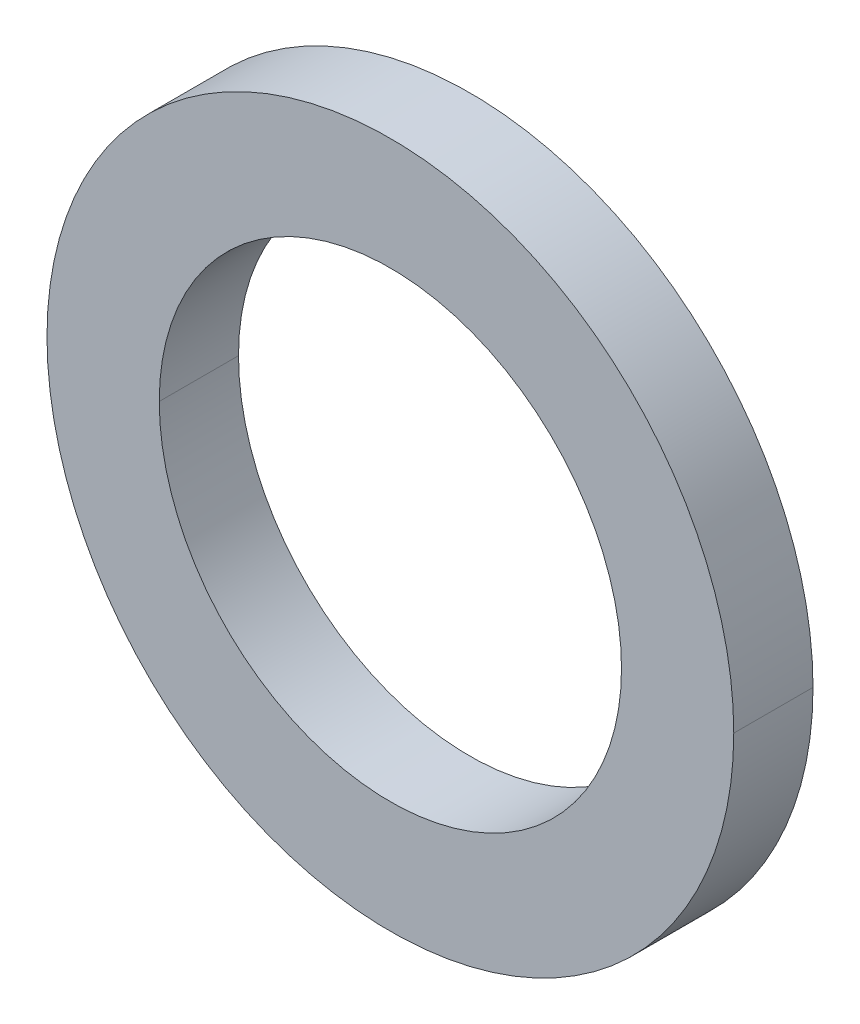
ISO-10303-21;
HEADER;
FILE_DESCRIPTION(('STEP AP214'),'2;1');
FILE_NAME('part.step','',(''),(''),'','','');
FILE_SCHEMA(('AUTOMOTIVE_DESIGN { 1 0 10303 214 1 1 1 1 }'));
ENDSEC;
DATA;
#1=APPLICATION_CONTEXT('core data for automotive mechanical design processes');
#2=APPLICATION_PROTOCOL_DEFINITION('international standard','automotive_design',2000,#1);
#3=PRODUCT_CONTEXT('',#1,'mechanical');
#4=PRODUCT('Part','Part','',(#3));
#5=PRODUCT_RELATED_PRODUCT_CATEGORY('part','',(#4));
#6=PRODUCT_DEFINITION_FORMATION('','',#4);
#7=PRODUCT_DEFINITION_CONTEXT('part definition',#1,'design');
#8=PRODUCT_DEFINITION('design','',#6,#7);
#9=PRODUCT_DEFINITION_SHAPE('','',#8);
#10=(LENGTH_UNIT() NAMED_UNIT(*) SI_UNIT(.MILLI.,.METRE.));
#11=(NAMED_UNIT(*) PLANE_ANGLE_UNIT() SI_UNIT($,.RADIAN.));
#12=(NAMED_UNIT(*) SI_UNIT($,.STERADIAN.) SOLID_ANGLE_UNIT());
#13=UNCERTAINTY_MEASURE_WITH_UNIT(LENGTH_MEASURE(1.E-05),#10,'distance_accuracy_value','');
#14=(GEOMETRIC_REPRESENTATION_CONTEXT(3) GLOBAL_UNCERTAINTY_ASSIGNED_CONTEXT((#13)) GLOBAL_UNIT_ASSIGNED_CONTEXT((#10,
#11,#12)) REPRESENTATION_CONTEXT('',''));
#15=CARTESIAN_POINT('',(0.,0.,0.));
#16=DIRECTION('',(0.,0.,1.));
#17=DIRECTION('',(1.,0.,0.));
#18=AXIS2_PLACEMENT_3D('',#15,#16,#17);
#19=CARTESIAN_POINT('',(0.,0.,35.3));
#20=DIRECTION('',(0.,0.,1.));
#21=DIRECTION('',(1.,0.,0.));
#22=AXIS2_PLACEMENT_3D('',#19,#20,#21);
#23=CYLINDRICAL_SURFACE('',#22,26.);
#24=DIRECTION('',(0.,0.,1.));
#25=VECTOR('',#24,1.);
#26=CARTESIAN_POINT('',(26.,0.,35.3));
#27=LINE('',#26,#25);
#28=CARTESIAN_POINT('',(26.,0.,32.3));
#29=VERTEX_POINT('',#28);
#30=CARTESIAN_POINT('',(26.,0.,38.3));
#31=VERTEX_POINT('',#30);
#32=EDGE_CURVE('E36',#29,#31,#27,.T.);
#33=ORIENTED_EDGE('',*,*,#32,.F.);
#34=CARTESIAN_POINT('',(0.,0.,32.3));
#35=DIRECTION('',(0.,0.,1.));
#36=DIRECTION('',(1.,0.,0.));
#37=AXIS2_PLACEMENT_3D('',#34,#35,#36);
#38=CIRCLE('',#37,26.);
#39=CARTESIAN_POINT('',(-26.,0.,32.3));
#40=VERTEX_POINT('',#39);
#41=EDGE_CURVE('E11',#29,#40,#38,.T.);
#42=ORIENTED_EDGE('',*,*,#41,.T.);
#43=DIRECTION('',(0.,0.,1.));
#44=VECTOR('',#43,1.);
#45=CARTESIAN_POINT('',(-26.,0.,35.3));
#46=LINE('',#45,#44);
#47=CARTESIAN_POINT('',(-26.,0.,38.3));
#48=VERTEX_POINT('',#47);
#49=EDGE_CURVE('E28',#40,#48,#46,.T.);
#50=ORIENTED_EDGE('',*,*,#49,.T.);
#51=CARTESIAN_POINT('',(0.,0.,38.3));
#52=DIRECTION('',(0.,0.,1.));
#53=DIRECTION('',(1.,0.,0.));
#54=AXIS2_PLACEMENT_3D('',#51,#52,#53);
#55=CIRCLE('',#54,26.);
#56=EDGE_CURVE('E67',#31,#48,#55,.T.);
#57=ORIENTED_EDGE('',*,*,#56,.F.);
#58=EDGE_LOOP('',(#33,#42,#50,#57));
#59=FACE_BOUND('',#58,.T.);
#60=ADVANCED_FACE('F17',(#59),#23,.T.);
#61=CARTESIAN_POINT('',(0.,0.,35.3));
#62=DIRECTION('',(0.,0.,1.));
#63=DIRECTION('',(1.,0.,0.));
#64=AXIS2_PLACEMENT_3D('',#61,#62,#63);
#65=CYLINDRICAL_SURFACE('',#64,26.);
#66=ORIENTED_EDGE('',*,*,#49,.F.);
#67=CARTESIAN_POINT('',(0.,0.,32.3));
#68=DIRECTION('',(0.,0.,1.));
#69=DIRECTION('',(1.,0.,0.));
#70=AXIS2_PLACEMENT_3D('',#67,#68,#69);
#71=CIRCLE('',#70,26.);
#72=EDGE_CURVE('E92',#40,#29,#71,.T.);
#73=ORIENTED_EDGE('',*,*,#72,.T.);
#74=ORIENTED_EDGE('',*,*,#32,.T.);
#75=CARTESIAN_POINT('',(0.,0.,38.3));
#76=DIRECTION('',(0.,0.,1.));
#77=DIRECTION('',(1.,0.,0.));
#78=AXIS2_PLACEMENT_3D('',#75,#76,#77);
#79=CIRCLE('',#78,26.);
#80=EDGE_CURVE('E88',#48,#31,#79,.T.);
#81=ORIENTED_EDGE('',*,*,#80,.F.);
#82=EDGE_LOOP('',(#66,#73,#74,#81));
#83=FACE_BOUND('',#82,.T.);
#84=ADVANCED_FACE('F105',(#83),#65,.T.);
#85=CARTESIAN_POINT('',(0.,0.,35.3));
#86=DIRECTION('',(0.,0.,1.));
#87=DIRECTION('',(1.,0.,0.));
#88=AXIS2_PLACEMENT_3D('',#85,#86,#87);
#89=CYLINDRICAL_SURFACE('',#88,17.5);
#90=CARTESIAN_POINT('',(0.,0.,38.3));
#91=DIRECTION('',(0.,0.,1.));
#92=DIRECTION('',(1.,0.,0.));
#93=AXIS2_PLACEMENT_3D('',#90,#91,#92);
#94=CIRCLE('',#93,17.5);
#95=CARTESIAN_POINT('',(-17.5,0.,38.3));
#96=VERTEX_POINT('',#95);
#97=CARTESIAN_POINT('',(17.5,0.,38.3));
#98=VERTEX_POINT('',#97);
#99=EDGE_CURVE('E75',#96,#98,#94,.T.);
#100=ORIENTED_EDGE('',*,*,#99,.T.);
#101=DIRECTION('',(0.,0.,1.));
#102=VECTOR('',#101,1.);
#103=CARTESIAN_POINT('',(17.5,0.,35.3));
#104=LINE('',#103,#102);
#105=CARTESIAN_POINT('',(17.5,0.,32.3));
#106=VERTEX_POINT('',#105);
#107=EDGE_CURVE('E64',#106,#98,#104,.T.);
#108=ORIENTED_EDGE('',*,*,#107,.F.);
#109=CARTESIAN_POINT('',(0.,0.,32.3));
#110=DIRECTION('',(0.,0.,1.));
#111=DIRECTION('',(1.,0.,0.));
#112=AXIS2_PLACEMENT_3D('',#109,#110,#111);
#113=CIRCLE('',#112,17.5);
#114=CARTESIAN_POINT('',(-17.5,0.,32.3));
#115=VERTEX_POINT('',#114);
#116=EDGE_CURVE('E56',#115,#106,#113,.T.);
#117=ORIENTED_EDGE('',*,*,#116,.F.);
#118=DIRECTION('',(0.,0.,1.));
#119=VECTOR('',#118,1.);
#120=CARTESIAN_POINT('',(-17.5,0.,35.3));
#121=LINE('',#120,#119);
#122=EDGE_CURVE('E62',#115,#96,#121,.T.);
#123=ORIENTED_EDGE('',*,*,#122,.T.);
#124=EDGE_LOOP('',(#100,#108,#117,#123));
#125=FACE_BOUND('',#124,.T.);
#126=ADVANCED_FACE('F61',(#125),#89,.F.);
#127=CARTESIAN_POINT('',(0.,0.,35.3));
#128=DIRECTION('',(0.,0.,1.));
#129=DIRECTION('',(1.,0.,0.));
#130=AXIS2_PLACEMENT_3D('',#127,#128,#129);
#131=CYLINDRICAL_SURFACE('',#130,17.5);
#132=CARTESIAN_POINT('',(0.,0.,38.3));
#133=DIRECTION('',(0.,0.,1.));
#134=DIRECTION('',(1.,0.,0.));
#135=AXIS2_PLACEMENT_3D('',#132,#133,#134);
#136=CIRCLE('',#135,17.5);
#137=EDGE_CURVE('E73',#98,#96,#136,.T.);
#138=ORIENTED_EDGE('',*,*,#137,.T.);
#139=ORIENTED_EDGE('',*,*,#122,.F.);
#140=CARTESIAN_POINT('',(0.,0.,32.3));
#141=DIRECTION('',(0.,0.,1.));
#142=DIRECTION('',(1.,0.,0.));
#143=AXIS2_PLACEMENT_3D('',#140,#141,#142);
#144=CIRCLE('',#143,17.5);
#145=EDGE_CURVE('E21',#106,#115,#144,.T.);
#146=ORIENTED_EDGE('',*,*,#145,.F.);
#147=ORIENTED_EDGE('',*,*,#107,.T.);
#148=EDGE_LOOP('',(#138,#139,#146,#147));
#149=FACE_BOUND('',#148,.T.);
#150=ADVANCED_FACE('F71',(#149),#131,.F.);
#151=CARTESIAN_POINT('',(0.,0.,32.3));
#152=DIRECTION('',(0.,0.,1.));
#153=DIRECTION('',(1.,0.,0.));
#154=AXIS2_PLACEMENT_3D('',#151,#152,#153);
#155=PLANE('',#154);
#156=ORIENTED_EDGE('',*,*,#72,.F.);
#157=ORIENTED_EDGE('',*,*,#41,.F.);
#158=EDGE_LOOP('',(#156,#157));
#159=FACE_BOUND('',#158,.T.);
#160=ORIENTED_EDGE('',*,*,#145,.T.);
#161=ORIENTED_EDGE('',*,*,#116,.T.);
#162=EDGE_LOOP('',(#160,#161));
#163=FACE_BOUND('',#162,.T.);
#164=ADVANCED_FACE('F77',(#159,#163),#155,.F.);
#165=CARTESIAN_POINT('',(0.,0.,38.3));
#166=DIRECTION('',(0.,0.,1.));
#167=DIRECTION('',(1.,0.,0.));
#168=AXIS2_PLACEMENT_3D('',#165,#166,#167);
#169=PLANE('',#168);
#170=ORIENTED_EDGE('',*,*,#56,.T.);
#171=ORIENTED_EDGE('',*,*,#80,.T.);
#172=EDGE_LOOP('',(#170,#171));
#173=FACE_BOUND('',#172,.T.);
#174=ORIENTED_EDGE('',*,*,#99,.F.);
#175=ORIENTED_EDGE('',*,*,#137,.F.);
#176=EDGE_LOOP('',(#174,#175));
#177=FACE_BOUND('',#176,.T.);
#178=ADVANCED_FACE('F19',(#173,#177),#169,.T.);
#179=CLOSED_SHELL('',(#60,#84,#126,#150,#164,#178));
#180=MANIFOLD_SOLID_BREP('B1',#179);
#181=ADVANCED_BREP_SHAPE_REPRESENTATION('',(#18,#180),#14);
#182=SHAPE_DEFINITION_REPRESENTATION(#9,#181);
ENDSEC;
END-ISO-10303-21;
